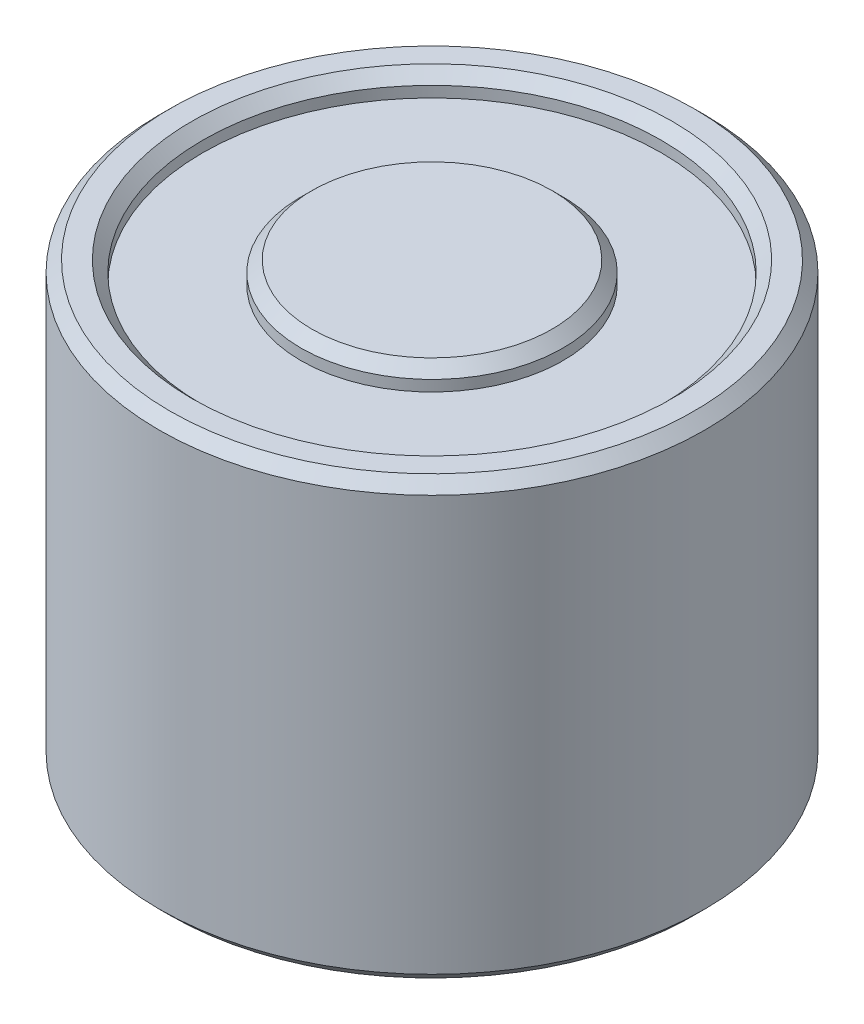
ISO-10303-21;
HEADER;
FILE_DESCRIPTION(('STEP AP214'),'2;1');
FILE_NAME('part.step','',(''),(''),'','','');
FILE_SCHEMA(('AUTOMOTIVE_DESIGN { 1 0 10303 214 1 1 1 1 }'));
ENDSEC;
DATA;
#1=APPLICATION_CONTEXT('core data for automotive mechanical design processes');
#2=APPLICATION_PROTOCOL_DEFINITION('international standard','automotive_design',2000,#1);
#3=PRODUCT_CONTEXT('',#1,'mechanical');
#4=PRODUCT('Part','Part','',(#3));
#5=PRODUCT_RELATED_PRODUCT_CATEGORY('part','',(#4));
#6=PRODUCT_DEFINITION_FORMATION('','',#4);
#7=PRODUCT_DEFINITION_CONTEXT('part definition',#1,'design');
#8=PRODUCT_DEFINITION('design','',#6,#7);
#9=PRODUCT_DEFINITION_SHAPE('','',#8);
#10=(LENGTH_UNIT() NAMED_UNIT(*) SI_UNIT(.MILLI.,.METRE.));
#11=(NAMED_UNIT(*) PLANE_ANGLE_UNIT() SI_UNIT($,.RADIAN.));
#12=(NAMED_UNIT(*) SI_UNIT($,.STERADIAN.) SOLID_ANGLE_UNIT());
#13=UNCERTAINTY_MEASURE_WITH_UNIT(LENGTH_MEASURE(1.E-05),#10,'distance_accuracy_value','');
#14=(GEOMETRIC_REPRESENTATION_CONTEXT(3) GLOBAL_UNCERTAINTY_ASSIGNED_CONTEXT((#13)) GLOBAL_UNIT_ASSIGNED_CONTEXT((#10,
#11,#12)) REPRESENTATION_CONTEXT('',''));
#15=CARTESIAN_POINT('',(0.,0.,0.));
#16=DIRECTION('',(0.,0.,1.));
#17=DIRECTION('',(1.,0.,0.));
#18=AXIS2_PLACEMENT_3D('',#15,#16,#17);
#19=CARTESIAN_POINT('',(0.,20.,0.));
#20=DIRECTION('',(0.,-1.,0.));
#21=DIRECTION('',(0.,0.,-1.));
#22=AXIS2_PLACEMENT_3D('',#19,#20,#21);
#23=CYLINDRICAL_SURFACE('',#22,12.5);
#24=CARTESIAN_POINT('',(0.,0.500000000000004,0.));
#25=DIRECTION('',(0.,1.,0.));
#26=DIRECTION('',(0.,0.,1.));
#27=AXIS2_PLACEMENT_3D('',#24,#25,#26);
#28=CIRCLE('',#27,12.5);
#29=CARTESIAN_POINT('',(0.,0.500000000000004,12.5));
#30=VERTEX_POINT('',#29);
#31=EDGE_CURVE('E53',#30,#30,#28,.T.);
#32=ORIENTED_EDGE('',*,*,#31,.T.);
#33=EDGE_LOOP('',(#32));
#34=FACE_BOUND('',#33,.T.);
#35=CARTESIAN_POINT('',(0.,19.5,0.));
#36=DIRECTION('',(0.,1.,0.));
#37=DIRECTION('',(0.,0.,1.));
#38=AXIS2_PLACEMENT_3D('',#35,#36,#37);
#39=CIRCLE('',#38,12.5);
#40=CARTESIAN_POINT('',(0.,19.5,12.5));
#41=VERTEX_POINT('',#40);
#42=EDGE_CURVE('E58',#41,#41,#39,.F.);
#43=ORIENTED_EDGE('',*,*,#42,.T.);
#44=EDGE_LOOP('',(#43));
#45=FACE_BOUND('',#44,.T.);
#46=ADVANCED_FACE('F37',(#34,#45),#23,.T.);
#47=CARTESIAN_POINT('',(0.,20.,0.));
#48=DIRECTION('',(0.,1.,0.));
#49=DIRECTION('',(0.,0.,1.));
#50=AXIS2_PLACEMENT_3D('',#47,#48,#49);
#51=PLANE('',#50);
#52=CARTESIAN_POINT('',(0.,20.,0.));
#53=DIRECTION('',(0.,1.,0.));
#54=DIRECTION('',(0.,0.,1.));
#55=AXIS2_PLACEMENT_3D('',#52,#53,#54);
#56=CIRCLE('',#55,11.);
#57=CARTESIAN_POINT('',(0.,20.,11.));
#58=VERTEX_POINT('',#57);
#59=EDGE_CURVE('E67',#58,#58,#56,.F.);
#60=ORIENTED_EDGE('',*,*,#59,.T.);
#61=EDGE_LOOP('',(#60));
#62=FACE_BOUND('',#61,.T.);
#63=CARTESIAN_POINT('',(0.,20.,0.));
#64=DIRECTION('',(0.,1.,0.));
#65=DIRECTION('',(0.,0.,1.));
#66=AXIS2_PLACEMENT_3D('',#63,#64,#65);
#67=CIRCLE('',#66,12.);
#68=CARTESIAN_POINT('',(0.,20.,12.));
#69=VERTEX_POINT('',#68);
#70=EDGE_CURVE('E70',#69,#69,#67,.T.);
#71=ORIENTED_EDGE('',*,*,#70,.T.);
#72=EDGE_LOOP('',(#71));
#73=FACE_BOUND('',#72,.T.);
#74=ADVANCED_FACE('F101',(#62,#73),#51,.T.);
#75=CARTESIAN_POINT('',(0.,0.,0.));
#76=DIRECTION('',(0.,1.,0.));
#77=DIRECTION('',(0.,0.,1.));
#78=AXIS2_PLACEMENT_3D('',#75,#76,#77);
#79=PLANE('',#78);
#80=CARTESIAN_POINT('',(0.,0.,0.));
#81=DIRECTION('',(0.,1.,0.));
#82=DIRECTION('',(0.,0.,1.));
#83=AXIS2_PLACEMENT_3D('',#80,#81,#82);
#84=CIRCLE('',#83,3.);
#85=CARTESIAN_POINT('',(0.,0.,3.));
#86=VERTEX_POINT('',#85);
#87=EDGE_CURVE('E10',#86,#86,#84,.T.);
#88=ORIENTED_EDGE('',*,*,#87,.T.);
#89=EDGE_LOOP('',(#88));
#90=FACE_BOUND('',#89,.T.);
#91=CARTESIAN_POINT('',(0.,0.,0.));
#92=DIRECTION('',(0.,1.,0.));
#93=DIRECTION('',(0.,0.,1.));
#94=AXIS2_PLACEMENT_3D('',#91,#92,#93);
#95=CIRCLE('',#94,12.);
#96=CARTESIAN_POINT('',(0.,0.,12.));
#97=VERTEX_POINT('',#96);
#98=EDGE_CURVE('E49',#97,#97,#95,.F.);
#99=ORIENTED_EDGE('',*,*,#98,.T.);
#100=EDGE_LOOP('',(#99));
#101=FACE_BOUND('',#100,.T.);
#102=ADVANCED_FACE('F107',(#90,#101),#79,.F.);
#103=CARTESIAN_POINT('',(0.,19.,0.));
#104=DIRECTION('',(0.,1.,0.));
#105=DIRECTION('',(0.,0.,1.));
#106=AXIS2_PLACEMENT_3D('',#103,#104,#105);
#107=CYLINDRICAL_SURFACE('',#106,10.5);
#108=CARTESIAN_POINT('',(0.,19.5,0.));
#109=DIRECTION('',(0.,1.,0.));
#110=DIRECTION('',(0.,0.,1.));
#111=AXIS2_PLACEMENT_3D('',#108,#109,#110);
#112=CIRCLE('',#111,10.5);
#113=CARTESIAN_POINT('',(0.,19.5,10.5));
#114=VERTEX_POINT('',#113);
#115=EDGE_CURVE('E73',#114,#114,#112,.T.);
#116=ORIENTED_EDGE('',*,*,#115,.T.);
#117=EDGE_LOOP('',(#116));
#118=FACE_BOUND('',#117,.T.);
#119=CARTESIAN_POINT('',(0.,19.,0.));
#120=DIRECTION('',(0.,1.,0.));
#121=DIRECTION('',(0.,0.,1.));
#122=AXIS2_PLACEMENT_3D('',#119,#120,#121);
#123=CIRCLE('',#122,10.5);
#124=CARTESIAN_POINT('',(0.,19.,10.5));
#125=VERTEX_POINT('',#124);
#126=EDGE_CURVE('E76',#125,#125,#123,.T.);
#127=ORIENTED_EDGE('',*,*,#126,.F.);
#128=EDGE_LOOP('',(#127));
#129=FACE_BOUND('',#128,.T.);
#130=ADVANCED_FACE('F145',(#118,#129),#107,.F.);
#131=CARTESIAN_POINT('',(0.,19.,0.));
#132=DIRECTION('',(0.,1.,0.));
#133=DIRECTION('',(0.,0.,1.));
#134=AXIS2_PLACEMENT_3D('',#131,#132,#133);
#135=PLANE('',#134);
#136=CARTESIAN_POINT('',(0.,19.,0.));
#137=DIRECTION('',(0.,1.,0.));
#138=DIRECTION('',(0.,0.,1.));
#139=AXIS2_PLACEMENT_3D('',#136,#137,#138);
#140=CIRCLE('',#139,6.);
#141=CARTESIAN_POINT('',(0.,19.,6.));
#142=VERTEX_POINT('',#141);
#143=EDGE_CURVE('E79',#142,#142,#140,.T.);
#144=ORIENTED_EDGE('',*,*,#143,.F.);
#145=EDGE_LOOP('',(#144));
#146=FACE_BOUND('',#145,.T.);
#147=ORIENTED_EDGE('',*,*,#126,.T.);
#148=EDGE_LOOP('',(#147));
#149=FACE_BOUND('',#148,.T.);
#150=ADVANCED_FACE('F150',(#146,#149),#135,.T.);
#151=CARTESIAN_POINT('',(0.,19.,0.));
#152=DIRECTION('',(0.,1.,0.));
#153=DIRECTION('',(0.,0.,1.));
#154=AXIS2_PLACEMENT_3D('',#151,#152,#153);
#155=CYLINDRICAL_SURFACE('',#154,6.);
#156=CARTESIAN_POINT('',(0.,19.5,0.));
#157=DIRECTION('',(0.,1.,0.));
#158=DIRECTION('',(0.,0.,1.));
#159=AXIS2_PLACEMENT_3D('',#156,#157,#158);
#160=CIRCLE('',#159,6.);
#161=CARTESIAN_POINT('',(0.,19.5,6.));
#162=VERTEX_POINT('',#161);
#163=EDGE_CURVE('E61',#162,#162,#160,.F.);
#164=ORIENTED_EDGE('',*,*,#163,.T.);
#165=EDGE_LOOP('',(#164));
#166=FACE_BOUND('',#165,.T.);
#167=ORIENTED_EDGE('',*,*,#143,.T.);
#168=EDGE_LOOP('',(#167));
#169=FACE_BOUND('',#168,.T.);
#170=ADVANCED_FACE('F157',(#166,#169),#155,.T.);
#171=CARTESIAN_POINT('',(0.,20.,0.));
#172=DIRECTION('',(0.,1.,0.));
#173=DIRECTION('',(0.,0.,1.));
#174=AXIS2_PLACEMENT_3D('',#171,#172,#173);
#175=CIRCLE('',#174,5.5);
#176=CARTESIAN_POINT('',(0.,20.,5.5));
#177=VERTEX_POINT('',#176);
#178=EDGE_CURVE('E64',#177,#177,#175,.T.);
#179=ORIENTED_EDGE('',*,*,#178,.T.);
#180=EDGE_LOOP('',(#179));
#181=FACE_BOUND('',#180,.T.);
#182=ADVANCED_FACE('F110',(#181),#51,.T.);
#183=CARTESIAN_POINT('',(0.,19.5,0.));
#184=DIRECTION('',(0.,1.,0.));
#185=DIRECTION('',(0.,0.,1.));
#186=AXIS2_PLACEMENT_3D('',#183,#184,#185);
#187=CONICAL_SURFACE('',#186,10.5,0.78539816339746);
#188=ORIENTED_EDGE('',*,*,#59,.F.);
#189=EDGE_LOOP('',(#188));
#190=FACE_BOUND('',#189,.T.);
#191=ORIENTED_EDGE('',*,*,#115,.F.);
#192=EDGE_LOOP('',(#191));
#193=FACE_BOUND('',#192,.T.);
#194=ADVANCED_FACE('F115',(#190,#193),#187,.F.);
#195=CARTESIAN_POINT('',(0.,20.,0.));
#196=DIRECTION('',(0.,-1.,0.));
#197=DIRECTION('',(0.,0.,-1.));
#198=AXIS2_PLACEMENT_3D('',#195,#196,#197);
#199=CONICAL_SURFACE('',#198,5.5,0.785398163397444);
#200=ORIENTED_EDGE('',*,*,#163,.F.);
#201=EDGE_LOOP('',(#200));
#202=FACE_BOUND('',#201,.T.);
#203=ORIENTED_EDGE('',*,*,#178,.F.);
#204=EDGE_LOOP('',(#203));
#205=FACE_BOUND('',#204,.T.);
#206=ADVANCED_FACE('F121',(#202,#205),#199,.T.);
#207=CARTESIAN_POINT('',(0.,0.500000000000004,0.));
#208=DIRECTION('',(0.,1.,0.));
#209=DIRECTION('',(0.,0.,1.));
#210=AXIS2_PLACEMENT_3D('',#207,#208,#209);
#211=CONICAL_SURFACE('',#210,12.5,0.785398163397448);
#212=ORIENTED_EDGE('',*,*,#98,.F.);
#213=EDGE_LOOP('',(#212));
#214=FACE_BOUND('',#213,.T.);
#215=ORIENTED_EDGE('',*,*,#31,.F.);
#216=EDGE_LOOP('',(#215));
#217=FACE_BOUND('',#216,.T.);
#218=ADVANCED_FACE('F97',(#214,#217),#211,.T.);
#219=CARTESIAN_POINT('',(0.,20.,0.));
#220=DIRECTION('',(0.,-1.,0.));
#221=DIRECTION('',(0.,0.,-1.));
#222=AXIS2_PLACEMENT_3D('',#219,#220,#221);
#223=CONICAL_SURFACE('',#222,12.,0.785398163397448);
#224=ORIENTED_EDGE('',*,*,#42,.F.);
#225=EDGE_LOOP('',(#224));
#226=FACE_BOUND('',#225,.T.);
#227=ORIENTED_EDGE('',*,*,#70,.F.);
#228=EDGE_LOOP('',(#227));
#229=FACE_BOUND('',#228,.T.);
#230=ADVANCED_FACE('F90',(#226,#229),#223,.T.);
#231=CARTESIAN_POINT('',(0.,12.,0.));
#232=DIRECTION('',(0.,-1.,0.));
#233=DIRECTION('',(0.,0.,-1.));
#234=AXIS2_PLACEMENT_3D('',#231,#232,#233);
#235=CYLINDRICAL_SURFACE('',#234,2.);
#236=CARTESIAN_POINT('',(0.,0.999999999999999,0.));
#237=DIRECTION('',(0.,1.,0.));
#238=DIRECTION('',(0.,0.,1.));
#239=AXIS2_PLACEMENT_3D('',#236,#237,#238);
#240=CIRCLE('',#239,2.);
#241=CARTESIAN_POINT('',(0.,0.999999999999999,2.));
#242=VERTEX_POINT('',#241);
#243=EDGE_CURVE('E45',#242,#242,#240,.F.);
#244=ORIENTED_EDGE('',*,*,#243,.T.);
#245=EDGE_LOOP('',(#244));
#246=FACE_BOUND('',#245,.T.);
#247=CARTESIAN_POINT('',(0.,12.,0.));
#248=DIRECTION('',(0.,-1.,0.));
#249=DIRECTION('',(0.,0.,-1.));
#250=AXIS2_PLACEMENT_3D('',#247,#248,#249);
#251=CIRCLE('',#250,2.);
#252=CARTESIAN_POINT('',(0.,12.,-2.));
#253=VERTEX_POINT('',#252);
#254=EDGE_CURVE('E82',#253,#253,#251,.T.);
#255=ORIENTED_EDGE('',*,*,#254,.F.);
#256=EDGE_LOOP('',(#255));
#257=FACE_BOUND('',#256,.T.);
#258=ADVANCED_FACE('F88',(#246,#257),#235,.F.);
#259=CARTESIAN_POINT('',(0.,12.,0.));
#260=DIRECTION('',(0.,-1.,0.));
#261=DIRECTION('',(0.,0.,-1.));
#262=AXIS2_PLACEMENT_3D('',#259,#260,#261);
#263=PLANE('',#262);
#264=ORIENTED_EDGE('',*,*,#254,.T.);
#265=EDGE_LOOP('',(#264));
#266=FACE_BOUND('',#265,.T.);
#267=ADVANCED_FACE('F86',(#266),#263,.T.);
#268=CARTESIAN_POINT('',(0.,0.999999999999999,0.));
#269=DIRECTION('',(0.,-1.,0.));
#270=DIRECTION('',(0.,0.,-1.));
#271=AXIS2_PLACEMENT_3D('',#268,#269,#270);
#272=CONICAL_SURFACE('',#271,2.,0.78539816339745);
#273=ORIENTED_EDGE('',*,*,#87,.F.);
#274=EDGE_LOOP('',(#273));
#275=FACE_BOUND('',#274,.T.);
#276=ORIENTED_EDGE('',*,*,#243,.F.);
#277=EDGE_LOOP('',(#276));
#278=FACE_BOUND('',#277,.T.);
#279=ADVANCED_FACE('F40',(#275,#278),#272,.F.);
#280=CLOSED_SHELL('',(#46,#74,#102,#130,#150,#170,#182,#194,#206,#218,#230,#258,#267,#279));
#281=MANIFOLD_SOLID_BREP('B2',#280);
#282=ADVANCED_BREP_SHAPE_REPRESENTATION('',(#18,#281),#14);
#283=SHAPE_DEFINITION_REPRESENTATION(#9,#282);
ENDSEC;
END-ISO-10303-21;
